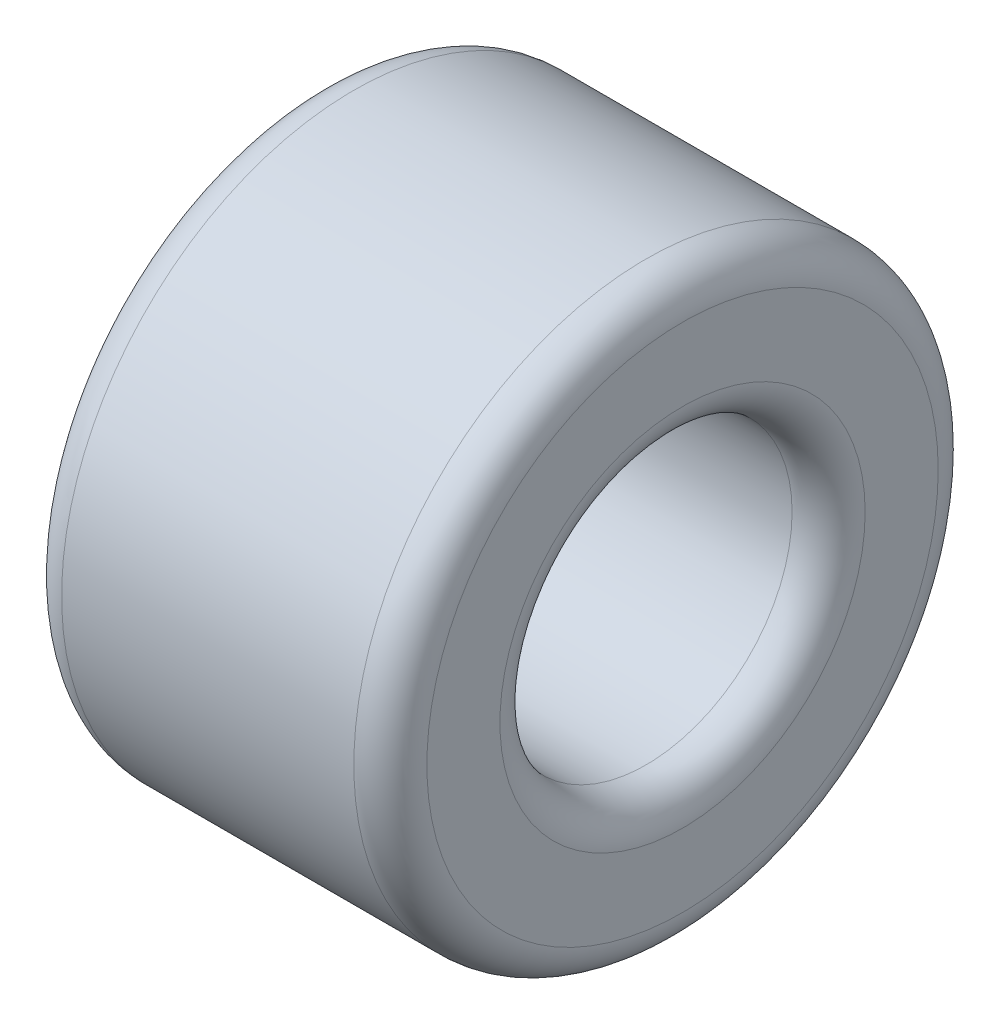
ISO-10303-21;
HEADER;
FILE_DESCRIPTION(('STEP AP214'),'2;1');
FILE_NAME('part.step','',(''),(''),'','','');
FILE_SCHEMA(('AUTOMOTIVE_DESIGN { 1 0 10303 214 1 1 1 1 }'));
ENDSEC;
DATA;
#1=APPLICATION_CONTEXT('core data for automotive mechanical design processes');
#2=APPLICATION_PROTOCOL_DEFINITION('international standard','automotive_design',2000,#1);
#3=PRODUCT_CONTEXT('',#1,'mechanical');
#4=PRODUCT('Part','Part','',(#3));
#5=PRODUCT_RELATED_PRODUCT_CATEGORY('part','',(#4));
#6=PRODUCT_DEFINITION_FORMATION('','',#4);
#7=PRODUCT_DEFINITION_CONTEXT('part definition',#1,'design');
#8=PRODUCT_DEFINITION('design','',#6,#7);
#9=PRODUCT_DEFINITION_SHAPE('','',#8);
#10=(LENGTH_UNIT() NAMED_UNIT(*) SI_UNIT(.MILLI.,.METRE.));
#11=(NAMED_UNIT(*) PLANE_ANGLE_UNIT() SI_UNIT($,.RADIAN.));
#12=(NAMED_UNIT(*) SI_UNIT($,.STERADIAN.) SOLID_ANGLE_UNIT());
#13=UNCERTAINTY_MEASURE_WITH_UNIT(LENGTH_MEASURE(1.E-05),#10,'distance_accuracy_value','');
#14=(GEOMETRIC_REPRESENTATION_CONTEXT(3) GLOBAL_UNCERTAINTY_ASSIGNED_CONTEXT((#13)) GLOBAL_UNIT_ASSIGNED_CONTEXT((#10,
#11,#12)) REPRESENTATION_CONTEXT('',''));
#15=CARTESIAN_POINT('',(0.,0.,0.));
#16=DIRECTION('',(0.,0.,1.));
#17=DIRECTION('',(1.,0.,0.));
#18=AXIS2_PLACEMENT_3D('',#15,#16,#17);
#19=CARTESIAN_POINT('',(5.,0.,0.));
#20=DIRECTION('',(1.,0.,0.));
#21=DIRECTION('',(0.,0.,-1.));
#22=AXIS2_PLACEMENT_3D('',#19,#20,#21);
#23=PLANE('',#22);
#24=CARTESIAN_POINT('',(5.,0.,0.));
#25=DIRECTION('',(1.,0.,0.));
#26=DIRECTION('',(0.,0.,-1.));
#27=AXIS2_PLACEMENT_3D('',#24,#25,#26);
#28=CIRCLE('',#27,7.);
#29=CARTESIAN_POINT('',(5.,0.,-7.));
#30=VERTEX_POINT('',#29);
#31=EDGE_CURVE('E10',#30,#30,#28,.T.);
#32=ORIENTED_EDGE('',*,*,#31,.T.);
#33=EDGE_LOOP('',(#32));
#34=FACE_BOUND('',#33,.T.);
#35=CARTESIAN_POINT('',(5.,0.,0.));
#36=DIRECTION('',(1.,0.,0.));
#37=DIRECTION('',(0.,0.,-1.));
#38=AXIS2_PLACEMENT_3D('',#35,#36,#37);
#39=CIRCLE('',#38,5.);
#40=CARTESIAN_POINT('',(5.,0.,-5.));
#41=VERTEX_POINT('',#40);
#42=EDGE_CURVE('E45',#41,#41,#39,.F.);
#43=ORIENTED_EDGE('',*,*,#42,.T.);
#44=EDGE_LOOP('',(#43));
#45=FACE_BOUND('',#44,.T.);
#46=ADVANCED_FACE('F37',(#34,#45),#23,.T.);
#47=CARTESIAN_POINT('',(-5.,0.,0.));
#48=DIRECTION('',(1.,0.,0.));
#49=DIRECTION('',(0.,0.,-1.));
#50=AXIS2_PLACEMENT_3D('',#47,#48,#49);
#51=PLANE('',#50);
#52=CARTESIAN_POINT('',(-5.,0.,0.));
#53=DIRECTION('',(1.,0.,0.));
#54=DIRECTION('',(0.,0.,-1.));
#55=AXIS2_PLACEMENT_3D('',#52,#53,#54);
#56=CIRCLE('',#55,5.);
#57=CARTESIAN_POINT('',(-5.,0.,-5.));
#58=VERTEX_POINT('',#57);
#59=EDGE_CURVE('E69',#58,#58,#56,.T.);
#60=ORIENTED_EDGE('',*,*,#59,.T.);
#61=EDGE_LOOP('',(#60));
#62=FACE_BOUND('',#61,.T.);
#63=CARTESIAN_POINT('',(-5.,0.,0.));
#64=DIRECTION('',(1.,0.,0.));
#65=DIRECTION('',(0.,0.,-1.));
#66=AXIS2_PLACEMENT_3D('',#63,#64,#65);
#67=CIRCLE('',#66,7.);
#68=CARTESIAN_POINT('',(-5.,0.,-7.));
#69=VERTEX_POINT('',#68);
#70=EDGE_CURVE('E73',#69,#69,#67,.F.);
#71=ORIENTED_EDGE('',*,*,#70,.T.);
#72=EDGE_LOOP('',(#71));
#73=FACE_BOUND('',#72,.T.);
#74=ADVANCED_FACE('F78',(#62,#73),#51,.F.);
#75=CARTESIAN_POINT('',(5.,0.,0.));
#76=DIRECTION('',(-1.,0.,0.));
#77=DIRECTION('',(0.,0.,1.));
#78=AXIS2_PLACEMENT_3D('',#75,#76,#77);
#79=CYLINDRICAL_SURFACE('',#78,8.);
#80=CARTESIAN_POINT('',(-4.,0.,0.));
#81=DIRECTION('',(1.,0.,0.));
#82=DIRECTION('',(0.,0.,-1.));
#83=AXIS2_PLACEMENT_3D('',#80,#81,#82);
#84=CIRCLE('',#83,8.);
#85=CARTESIAN_POINT('',(-4.,0.,-8.));
#86=VERTEX_POINT('',#85);
#87=EDGE_CURVE('E50',#86,#86,#84,.T.);
#88=ORIENTED_EDGE('',*,*,#87,.T.);
#89=EDGE_LOOP('',(#88));
#90=FACE_BOUND('',#89,.T.);
#91=CARTESIAN_POINT('',(4.,0.,0.));
#92=DIRECTION('',(1.,0.,0.));
#93=DIRECTION('',(0.,0.,-1.));
#94=AXIS2_PLACEMENT_3D('',#91,#92,#93);
#95=CIRCLE('',#94,8.);
#96=CARTESIAN_POINT('',(4.,0.,-8.));
#97=VERTEX_POINT('',#96);
#98=EDGE_CURVE('E55',#97,#97,#95,.F.);
#99=ORIENTED_EDGE('',*,*,#98,.T.);
#100=EDGE_LOOP('',(#99));
#101=FACE_BOUND('',#100,.T.);
#102=ADVANCED_FACE('F88',(#90,#101),#79,.T.);
#103=CARTESIAN_POINT('',(5.,0.,0.));
#104=DIRECTION('',(-1.,0.,0.));
#105=DIRECTION('',(0.,0.,1.));
#106=AXIS2_PLACEMENT_3D('',#103,#104,#105);
#107=CYLINDRICAL_SURFACE('',#106,4.);
#108=CARTESIAN_POINT('',(-4.,0.,0.));
#109=DIRECTION('',(1.,0.,0.));
#110=DIRECTION('',(0.,0.,-1.));
#111=AXIS2_PLACEMENT_3D('',#108,#109,#110);
#112=CIRCLE('',#111,4.);
#113=CARTESIAN_POINT('',(-4.,0.,-4.));
#114=VERTEX_POINT('',#113);
#115=EDGE_CURVE('E61',#114,#114,#112,.F.);
#116=ORIENTED_EDGE('',*,*,#115,.T.);
#117=EDGE_LOOP('',(#116));
#118=FACE_BOUND('',#117,.T.);
#119=CARTESIAN_POINT('',(4.,0.,0.));
#120=DIRECTION('',(1.,0.,0.));
#121=DIRECTION('',(0.,0.,-1.));
#122=AXIS2_PLACEMENT_3D('',#119,#120,#121);
#123=CIRCLE('',#122,4.);
#124=CARTESIAN_POINT('',(4.,0.,-4.));
#125=VERTEX_POINT('',#124);
#126=EDGE_CURVE('E65',#125,#125,#123,.T.);
#127=ORIENTED_EDGE('',*,*,#126,.T.);
#128=EDGE_LOOP('',(#127));
#129=FACE_BOUND('',#128,.T.);
#130=ADVANCED_FACE('F91',(#118,#129),#107,.F.);
#131=CARTESIAN_POINT('',(-4.,0.,0.));
#132=DIRECTION('',(1.,0.,0.));
#133=DIRECTION('',(0.,0.,-1.));
#134=AXIS2_PLACEMENT_3D('',#131,#132,#133);
#135=TOROIDAL_SURFACE('',#134,5.,1.);
#136=ORIENTED_EDGE('',*,*,#115,.F.);
#137=EDGE_LOOP('',(#136));
#138=FACE_BOUND('',#137,.T.);
#139=ORIENTED_EDGE('',*,*,#59,.F.);
#140=EDGE_LOOP('',(#139));
#141=FACE_BOUND('',#140,.T.);
#142=ADVANCED_FACE('F84',(#138,#141),#135,.T.);
#143=CARTESIAN_POINT('',(-4.,0.,0.));
#144=DIRECTION('',(1.,0.,0.));
#145=DIRECTION('',(0.,0.,-1.));
#146=AXIS2_PLACEMENT_3D('',#143,#144,#145);
#147=TOROIDAL_SURFACE('',#146,7.,1.);
#148=ORIENTED_EDGE('',*,*,#70,.F.);
#149=EDGE_LOOP('',(#148));
#150=FACE_BOUND('',#149,.T.);
#151=ORIENTED_EDGE('',*,*,#87,.F.);
#152=EDGE_LOOP('',(#151));
#153=FACE_BOUND('',#152,.T.);
#154=ADVANCED_FACE('F80',(#150,#153),#147,.T.);
#155=CARTESIAN_POINT('',(4.,0.,0.));
#156=DIRECTION('',(1.,0.,0.));
#157=DIRECTION('',(0.,0.,-1.));
#158=AXIS2_PLACEMENT_3D('',#155,#156,#157);
#159=TOROIDAL_SURFACE('',#158,7.,1.);
#160=ORIENTED_EDGE('',*,*,#98,.F.);
#161=EDGE_LOOP('',(#160));
#162=FACE_BOUND('',#161,.T.);
#163=ORIENTED_EDGE('',*,*,#31,.F.);
#164=EDGE_LOOP('',(#163));
#165=FACE_BOUND('',#164,.T.);
#166=ADVANCED_FACE('F83',(#162,#165),#159,.T.);
#167=CARTESIAN_POINT('',(4.,0.,0.));
#168=DIRECTION('',(1.,0.,0.));
#169=DIRECTION('',(0.,0.,-1.));
#170=AXIS2_PLACEMENT_3D('',#167,#168,#169);
#171=TOROIDAL_SURFACE('',#170,5.,1.);
#172=ORIENTED_EDGE('',*,*,#42,.F.);
#173=EDGE_LOOP('',(#172));
#174=FACE_BOUND('',#173,.T.);
#175=ORIENTED_EDGE('',*,*,#126,.F.);
#176=EDGE_LOOP('',(#175));
#177=FACE_BOUND('',#176,.T.);
#178=ADVANCED_FACE('F39',(#174,#177),#171,.T.);
#179=CLOSED_SHELL('',(#46,#74,#102,#130,#142,#154,#166,#178));
#180=MANIFOLD_SOLID_BREP('B2',#179);
#181=ADVANCED_BREP_SHAPE_REPRESENTATION('',(#18,#180),#14);
#182=SHAPE_DEFINITION_REPRESENTATION(#9,#181);
ENDSEC;
END-ISO-10303-21;
